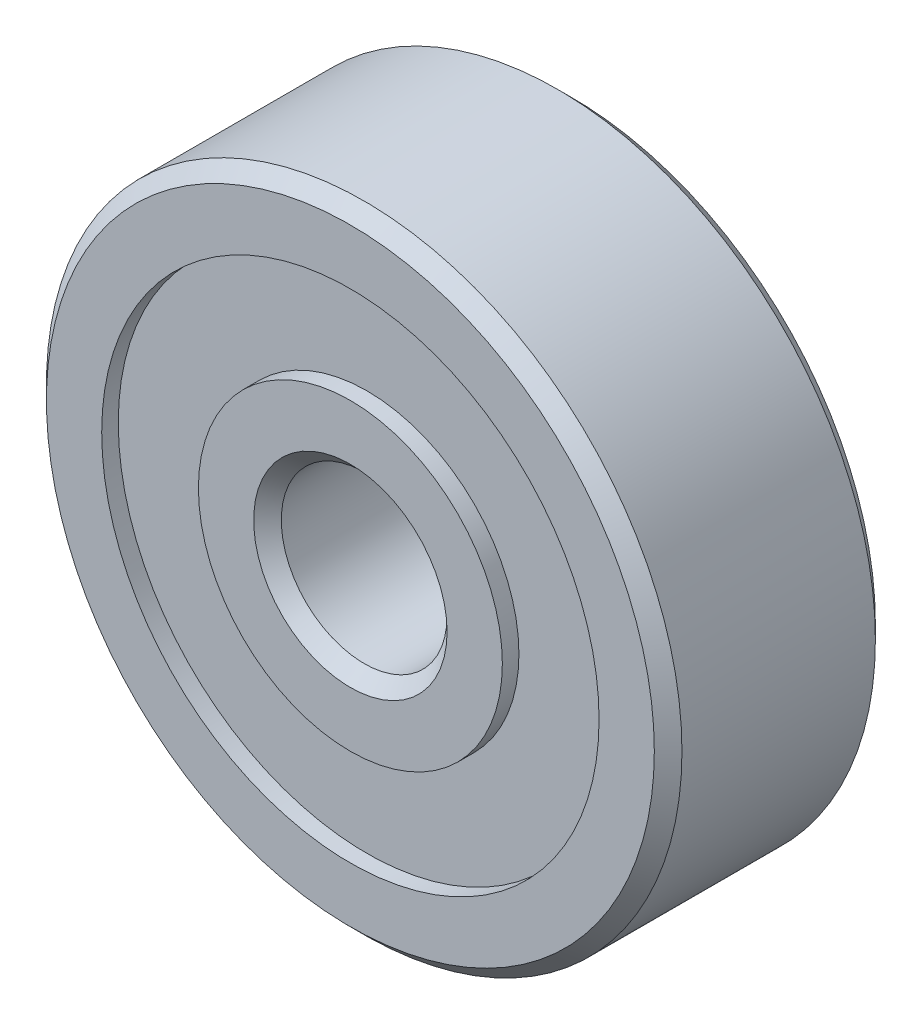
ISO-10303-21;
HEADER;
FILE_DESCRIPTION(('STEP AP214'),'2;1');
FILE_NAME('part.step','',(''),(''),'','','');
FILE_SCHEMA(('AUTOMOTIVE_DESIGN { 1 0 10303 214 1 1 1 1 }'));
ENDSEC;
DATA;
#1=APPLICATION_CONTEXT('core data for automotive mechanical design processes');
#2=APPLICATION_PROTOCOL_DEFINITION('international standard','automotive_design',2000,#1);
#3=PRODUCT_CONTEXT('',#1,'mechanical');
#4=PRODUCT('Part','Part','',(#3));
#5=PRODUCT_RELATED_PRODUCT_CATEGORY('part','',(#4));
#6=PRODUCT_DEFINITION_FORMATION('','',#4);
#7=PRODUCT_DEFINITION_CONTEXT('part definition',#1,'design');
#8=PRODUCT_DEFINITION('design','',#6,#7);
#9=PRODUCT_DEFINITION_SHAPE('','',#8);
#10=(LENGTH_UNIT() NAMED_UNIT(*) SI_UNIT(.MILLI.,.METRE.));
#11=(NAMED_UNIT(*) PLANE_ANGLE_UNIT() SI_UNIT($,.RADIAN.));
#12=(NAMED_UNIT(*) SI_UNIT($,.STERADIAN.) SOLID_ANGLE_UNIT());
#13=UNCERTAINTY_MEASURE_WITH_UNIT(LENGTH_MEASURE(1.E-05),#10,'distance_accuracy_value','');
#14=(GEOMETRIC_REPRESENTATION_CONTEXT(3) GLOBAL_UNCERTAINTY_ASSIGNED_CONTEXT((#13)) GLOBAL_UNIT_ASSIGNED_CONTEXT((#10,
#11,#12)) REPRESENTATION_CONTEXT('',''));
#15=CARTESIAN_POINT('',(0.,0.,0.));
#16=DIRECTION('',(0.,0.,1.));
#17=DIRECTION('',(1.,0.,0.));
#18=AXIS2_PLACEMENT_3D('',#15,#16,#17);
#19=CARTESIAN_POINT('',(0.,0.,-2.));
#20=DIRECTION('',(0.,0.,1.));
#21=DIRECTION('',(1.,0.,0.));
#22=AXIS2_PLACEMENT_3D('',#19,#20,#21);
#23=PLANE('',#22);
#24=CARTESIAN_POINT('',(0.,0.,-2.));
#25=DIRECTION('',(0.,0.,1.));
#26=DIRECTION('',(1.,0.,0.));
#27=AXIS2_PLACEMENT_3D('',#24,#25,#26);
#28=CIRCLE('',#27,5.5);
#29=CARTESIAN_POINT('',(5.5,0.,-2.));
#30=VERTEX_POINT('',#29);
#31=EDGE_CURVE('E62',#30,#30,#28,.F.);
#32=ORIENTED_EDGE('',*,*,#31,.T.);
#33=EDGE_LOOP('',(#32));
#34=FACE_BOUND('',#33,.T.);
#35=CARTESIAN_POINT('',(0.,0.,-2.));
#36=DIRECTION('',(0.,0.,1.));
#37=DIRECTION('',(1.,0.,0.));
#38=AXIS2_PLACEMENT_3D('',#35,#36,#37);
#39=CIRCLE('',#38,4.5);
#40=CARTESIAN_POINT('',(4.5,0.,-2.));
#41=VERTEX_POINT('',#40);
#42=EDGE_CURVE('E86',#41,#41,#39,.T.);
#43=ORIENTED_EDGE('',*,*,#42,.T.);
#44=EDGE_LOOP('',(#43));
#45=FACE_BOUND('',#44,.T.);
#46=ADVANCED_FACE('F33',(#34,#45),#23,.F.);
#47=CARTESIAN_POINT('',(0.,0.,-2.));
#48=DIRECTION('',(0.,0.,1.));
#49=DIRECTION('',(1.,0.,0.));
#50=AXIS2_PLACEMENT_3D('',#47,#48,#49);
#51=CIRCLE('',#50,1.75);
#52=CARTESIAN_POINT('',(1.75,0.,-2.));
#53=VERTEX_POINT('',#52);
#54=EDGE_CURVE('E59',#53,#53,#51,.T.);
#55=ORIENTED_EDGE('',*,*,#54,.T.);
#56=EDGE_LOOP('',(#55));
#57=FACE_BOUND('',#56,.T.);
#58=CARTESIAN_POINT('',(0.,0.,-2.));
#59=DIRECTION('',(0.,0.,1.));
#60=DIRECTION('',(1.,0.,0.));
#61=AXIS2_PLACEMENT_3D('',#58,#59,#60);
#62=CIRCLE('',#61,2.75);
#63=CARTESIAN_POINT('',(2.75,0.,-2.));
#64=VERTEX_POINT('',#63);
#65=EDGE_CURVE('E83',#64,#64,#62,.T.);
#66=ORIENTED_EDGE('',*,*,#65,.F.);
#67=EDGE_LOOP('',(#66));
#68=FACE_BOUND('',#67,.T.);
#69=ADVANCED_FACE('F110',(#57,#68),#23,.F.);
#70=CARTESIAN_POINT('',(0.,0.,2.));
#71=DIRECTION('',(0.,0.,1.));
#72=DIRECTION('',(1.,0.,0.));
#73=AXIS2_PLACEMENT_3D('',#70,#71,#72);
#74=PLANE('',#73);
#75=CARTESIAN_POINT('',(0.,0.,2.));
#76=DIRECTION('',(0.,0.,1.));
#77=DIRECTION('',(1.,0.,0.));
#78=AXIS2_PLACEMENT_3D('',#75,#76,#77);
#79=CIRCLE('',#78,5.50000000000001);
#80=CARTESIAN_POINT('',(5.50000000000001,0.,2.));
#81=VERTEX_POINT('',#80);
#82=EDGE_CURVE('E48',#81,#81,#79,.T.);
#83=ORIENTED_EDGE('',*,*,#82,.T.);
#84=EDGE_LOOP('',(#83));
#85=FACE_BOUND('',#84,.T.);
#86=CARTESIAN_POINT('',(0.,0.,2.));
#87=DIRECTION('',(0.,0.,1.));
#88=DIRECTION('',(1.,0.,0.));
#89=AXIS2_PLACEMENT_3D('',#86,#87,#88);
#90=CIRCLE('',#89,4.5);
#91=CARTESIAN_POINT('',(4.5,0.,2.));
#92=VERTEX_POINT('',#91);
#93=EDGE_CURVE('E74',#92,#92,#90,.T.);
#94=ORIENTED_EDGE('',*,*,#93,.F.);
#95=EDGE_LOOP('',(#94));
#96=FACE_BOUND('',#95,.T.);
#97=ADVANCED_FACE('F112',(#85,#96),#74,.T.);
#98=CARTESIAN_POINT('',(0.,0.,2.));
#99=DIRECTION('',(0.,0.,1.));
#100=DIRECTION('',(1.,0.,0.));
#101=AXIS2_PLACEMENT_3D('',#98,#99,#100);
#102=CIRCLE('',#101,1.75);
#103=CARTESIAN_POINT('',(1.75,0.,2.));
#104=VERTEX_POINT('',#103);
#105=EDGE_CURVE('E44',#104,#104,#102,.F.);
#106=ORIENTED_EDGE('',*,*,#105,.T.);
#107=EDGE_LOOP('',(#106));
#108=FACE_BOUND('',#107,.T.);
#109=CARTESIAN_POINT('',(0.,0.,2.));
#110=DIRECTION('',(0.,0.,1.));
#111=DIRECTION('',(1.,0.,0.));
#112=AXIS2_PLACEMENT_3D('',#109,#110,#111);
#113=CIRCLE('',#112,2.75);
#114=CARTESIAN_POINT('',(2.75,0.,2.));
#115=VERTEX_POINT('',#114);
#116=EDGE_CURVE('E71',#115,#115,#113,.T.);
#117=ORIENTED_EDGE('',*,*,#116,.T.);
#118=EDGE_LOOP('',(#117));
#119=FACE_BOUND('',#118,.T.);
#120=ADVANCED_FACE('F119',(#108,#119),#74,.T.);
#121=CARTESIAN_POINT('',(0.,0.,2.));
#122=DIRECTION('',(0.,0.,-1.));
#123=DIRECTION('',(-1.,0.,0.));
#124=AXIS2_PLACEMENT_3D('',#121,#122,#123);
#125=CYLINDRICAL_SURFACE('',#124,5.75);
#126=CARTESIAN_POINT('',(0.,0.,-1.75));
#127=DIRECTION('',(0.,0.,1.));
#128=DIRECTION('',(1.,0.,0.));
#129=AXIS2_PLACEMENT_3D('',#126,#127,#128);
#130=CIRCLE('',#129,5.75);
#131=CARTESIAN_POINT('',(5.75,0.,-1.75));
#132=VERTEX_POINT('',#131);
#133=EDGE_CURVE('E10',#132,#132,#130,.T.);
#134=ORIENTED_EDGE('',*,*,#133,.T.);
#135=EDGE_LOOP('',(#134));
#136=FACE_BOUND('',#135,.T.);
#137=CARTESIAN_POINT('',(0.,0.,1.75000000000001));
#138=DIRECTION('',(0.,0.,1.));
#139=DIRECTION('',(1.,0.,0.));
#140=AXIS2_PLACEMENT_3D('',#137,#138,#139);
#141=CIRCLE('',#140,5.75);
#142=CARTESIAN_POINT('',(5.75,0.,1.75000000000001));
#143=VERTEX_POINT('',#142);
#144=EDGE_CURVE('E40',#143,#143,#141,.F.);
#145=ORIENTED_EDGE('',*,*,#144,.T.);
#146=EDGE_LOOP('',(#145));
#147=FACE_BOUND('',#146,.T.);
#148=ADVANCED_FACE('F125',(#136,#147),#125,.T.);
#149=CARTESIAN_POINT('',(0.,0.,2.));
#150=DIRECTION('',(0.,0.,-1.));
#151=DIRECTION('',(-1.,0.,0.));
#152=AXIS2_PLACEMENT_3D('',#149,#150,#151);
#153=CYLINDRICAL_SURFACE('',#152,1.5);
#154=CARTESIAN_POINT('',(0.,0.,-1.75));
#155=DIRECTION('',(0.,0.,1.));
#156=DIRECTION('',(1.,0.,0.));
#157=AXIS2_PLACEMENT_3D('',#154,#155,#156);
#158=CIRCLE('',#157,1.5);
#159=CARTESIAN_POINT('',(1.5,0.,-1.75));
#160=VERTEX_POINT('',#159);
#161=EDGE_CURVE('E53',#160,#160,#158,.F.);
#162=ORIENTED_EDGE('',*,*,#161,.T.);
#163=EDGE_LOOP('',(#162));
#164=FACE_BOUND('',#163,.T.);
#165=CARTESIAN_POINT('',(0.,0.,1.75));
#166=DIRECTION('',(0.,0.,1.));
#167=DIRECTION('',(1.,0.,0.));
#168=AXIS2_PLACEMENT_3D('',#165,#166,#167);
#169=CIRCLE('',#168,1.5);
#170=CARTESIAN_POINT('',(1.5,0.,1.75));
#171=VERTEX_POINT('',#170);
#172=EDGE_CURVE('E56',#171,#171,#169,.T.);
#173=ORIENTED_EDGE('',*,*,#172,.T.);
#174=EDGE_LOOP('',(#173));
#175=FACE_BOUND('',#174,.T.);
#176=ADVANCED_FACE('F128',(#164,#175),#153,.F.);
#177=CARTESIAN_POINT('',(0.,0.,-2.));
#178=DIRECTION('',(0.,0.,-1.));
#179=DIRECTION('',(-1.,0.,0.));
#180=AXIS2_PLACEMENT_3D('',#177,#178,#179);
#181=CONICAL_SURFACE('',#180,1.75,0.785398163397449);
#182=ORIENTED_EDGE('',*,*,#161,.F.);
#183=EDGE_LOOP('',(#182));
#184=FACE_BOUND('',#183,.T.);
#185=ORIENTED_EDGE('',*,*,#54,.F.);
#186=EDGE_LOOP('',(#185));
#187=FACE_BOUND('',#186,.T.);
#188=ADVANCED_FACE('F129',(#184,#187),#181,.F.);
#189=CARTESIAN_POINT('',(0.,0.,1.75));
#190=DIRECTION('',(0.,0.,1.));
#191=DIRECTION('',(1.,0.,0.));
#192=AXIS2_PLACEMENT_3D('',#189,#190,#191);
#193=CONICAL_SURFACE('',#192,1.5,0.785398163397452);
#194=ORIENTED_EDGE('',*,*,#105,.F.);
#195=EDGE_LOOP('',(#194));
#196=FACE_BOUND('',#195,.T.);
#197=ORIENTED_EDGE('',*,*,#172,.F.);
#198=EDGE_LOOP('',(#197));
#199=FACE_BOUND('',#198,.T.);
#200=ADVANCED_FACE('F132',(#196,#199),#193,.F.);
#201=CARTESIAN_POINT('',(0.,0.,-1.75));
#202=DIRECTION('',(0.,0.,1.));
#203=DIRECTION('',(1.,0.,0.));
#204=AXIS2_PLACEMENT_3D('',#201,#202,#203);
#205=CONICAL_SURFACE('',#204,5.75,0.785398163397454);
#206=ORIENTED_EDGE('',*,*,#31,.F.);
#207=EDGE_LOOP('',(#206));
#208=FACE_BOUND('',#207,.T.);
#209=ORIENTED_EDGE('',*,*,#133,.F.);
#210=EDGE_LOOP('',(#209));
#211=FACE_BOUND('',#210,.T.);
#212=ADVANCED_FACE('F135',(#208,#211),#205,.T.);
#213=CARTESIAN_POINT('',(0.,0.,2.));
#214=DIRECTION('',(0.,0.,-1.));
#215=DIRECTION('',(-1.,0.,0.));
#216=AXIS2_PLACEMENT_3D('',#213,#214,#215);
#217=CONICAL_SURFACE('',#216,5.50000000000001,0.785398163397452);
#218=ORIENTED_EDGE('',*,*,#144,.F.);
#219=EDGE_LOOP('',(#218));
#220=FACE_BOUND('',#219,.T.);
#221=ORIENTED_EDGE('',*,*,#82,.F.);
#222=EDGE_LOOP('',(#221));
#223=FACE_BOUND('',#222,.T.);
#224=ADVANCED_FACE('F35',(#220,#223),#217,.T.);
#225=CARTESIAN_POINT('',(0.,0.,0.));
#226=DIRECTION('',(0.,0.,1.));
#227=DIRECTION('',(1.,0.,0.));
#228=AXIS2_PLACEMENT_3D('',#225,#226,#227);
#229=CYLINDRICAL_SURFACE('',#228,4.5);
#230=ORIENTED_EDGE('',*,*,#93,.T.);
#231=EDGE_LOOP('',(#230));
#232=FACE_BOUND('',#231,.T.);
#233=CARTESIAN_POINT('',(0.,0.,1.7));
#234=DIRECTION('',(0.,0.,1.));
#235=DIRECTION('',(1.,0.,0.));
#236=AXIS2_PLACEMENT_3D('',#233,#234,#235);
#237=CIRCLE('',#236,4.5);
#238=CARTESIAN_POINT('',(4.5,0.,1.7));
#239=VERTEX_POINT('',#238);
#240=EDGE_CURVE('E65',#239,#239,#237,.T.);
#241=ORIENTED_EDGE('',*,*,#240,.F.);
#242=EDGE_LOOP('',(#241));
#243=FACE_BOUND('',#242,.T.);
#244=ADVANCED_FACE('F142',(#232,#243),#229,.F.);
#245=CARTESIAN_POINT('',(-4.5,0.,1.7));
#246=DIRECTION('',(0.,0.,1.));
#247=DIRECTION('',(1.,0.,0.));
#248=AXIS2_PLACEMENT_3D('',#245,#246,#247);
#249=PLANE('',#248);
#250=ORIENTED_EDGE('',*,*,#240,.T.);
#251=EDGE_LOOP('',(#250));
#252=FACE_BOUND('',#251,.T.);
#253=CARTESIAN_POINT('',(0.,0.,1.7));
#254=DIRECTION('',(0.,0.,1.));
#255=DIRECTION('',(1.,0.,0.));
#256=AXIS2_PLACEMENT_3D('',#253,#254,#255);
#257=CIRCLE('',#256,2.75);
#258=CARTESIAN_POINT('',(2.75,0.,1.7));
#259=VERTEX_POINT('',#258);
#260=EDGE_CURVE('E68',#259,#259,#257,.T.);
#261=ORIENTED_EDGE('',*,*,#260,.F.);
#262=EDGE_LOOP('',(#261));
#263=FACE_BOUND('',#262,.T.);
#264=ADVANCED_FACE('F149',(#252,#263),#249,.T.);
#265=CARTESIAN_POINT('',(0.,0.,0.));
#266=DIRECTION('',(0.,0.,1.));
#267=DIRECTION('',(1.,0.,0.));
#268=AXIS2_PLACEMENT_3D('',#265,#266,#267);
#269=CYLINDRICAL_SURFACE('',#268,2.75);
#270=ORIENTED_EDGE('',*,*,#260,.T.);
#271=EDGE_LOOP('',(#270));
#272=FACE_BOUND('',#271,.T.);
#273=ORIENTED_EDGE('',*,*,#116,.F.);
#274=EDGE_LOOP('',(#273));
#275=FACE_BOUND('',#274,.T.);
#276=ADVANCED_FACE('F95',(#272,#275),#269,.T.);
#277=CARTESIAN_POINT('',(0.,0.,0.));
#278=DIRECTION('',(0.,0.,-1.));
#279=DIRECTION('',(1.,0.,0.));
#280=AXIS2_PLACEMENT_3D('',#277,#278,#279);
#281=CYLINDRICAL_SURFACE('',#280,4.5);
#282=ORIENTED_EDGE('',*,*,#42,.F.);
#283=EDGE_LOOP('',(#282));
#284=FACE_BOUND('',#283,.T.);
#285=CARTESIAN_POINT('',(0.,0.,-1.7));
#286=DIRECTION('',(0.,0.,1.));
#287=DIRECTION('',(1.,0.,0.));
#288=AXIS2_PLACEMENT_3D('',#285,#286,#287);
#289=CIRCLE('',#288,4.5);
#290=CARTESIAN_POINT('',(4.5,0.,-1.7));
#291=VERTEX_POINT('',#290);
#292=EDGE_CURVE('E77',#291,#291,#289,.T.);
#293=ORIENTED_EDGE('',*,*,#292,.T.);
#294=EDGE_LOOP('',(#293));
#295=FACE_BOUND('',#294,.T.);
#296=ADVANCED_FACE('F91',(#284,#295),#281,.F.);
#297=CARTESIAN_POINT('',(-4.5,0.,-1.7));
#298=DIRECTION('',(0.,0.,-1.));
#299=DIRECTION('',(1.,0.,0.));
#300=AXIS2_PLACEMENT_3D('',#297,#298,#299);
#301=PLANE('',#300);
#302=ORIENTED_EDGE('',*,*,#292,.F.);
#303=EDGE_LOOP('',(#302));
#304=FACE_BOUND('',#303,.T.);
#305=CARTESIAN_POINT('',(0.,0.,-1.7));
#306=DIRECTION('',(0.,0.,1.));
#307=DIRECTION('',(1.,0.,0.));
#308=AXIS2_PLACEMENT_3D('',#305,#306,#307);
#309=CIRCLE('',#308,2.75);
#310=CARTESIAN_POINT('',(2.75,0.,-1.7));
#311=VERTEX_POINT('',#310);
#312=EDGE_CURVE('E80',#311,#311,#309,.T.);
#313=ORIENTED_EDGE('',*,*,#312,.T.);
#314=EDGE_LOOP('',(#313));
#315=FACE_BOUND('',#314,.T.);
#316=ADVANCED_FACE('F94',(#304,#315),#301,.T.);
#317=CARTESIAN_POINT('',(0.,0.,0.));
#318=DIRECTION('',(0.,0.,-1.));
#319=DIRECTION('',(1.,0.,0.));
#320=AXIS2_PLACEMENT_3D('',#317,#318,#319);
#321=CYLINDRICAL_SURFACE('',#320,2.75);
#322=ORIENTED_EDGE('',*,*,#312,.F.);
#323=EDGE_LOOP('',(#322));
#324=FACE_BOUND('',#323,.T.);
#325=ORIENTED_EDGE('',*,*,#65,.T.);
#326=EDGE_LOOP('',(#325));
#327=FACE_BOUND('',#326,.T.);
#328=ADVANCED_FACE('F101',(#324,#327),#321,.T.);
#329=CLOSED_SHELL('',(#46,#69,#97,#120,#148,#176,#188,#200,#212,#224,#244,#264,#276,#296,#316,#328));
#330=MANIFOLD_SOLID_BREP('B2',#329);
#331=ADVANCED_BREP_SHAPE_REPRESENTATION('',(#18,#330),#14);
#332=SHAPE_DEFINITION_REPRESENTATION(#9,#331);
ENDSEC;
END-ISO-10303-21;
